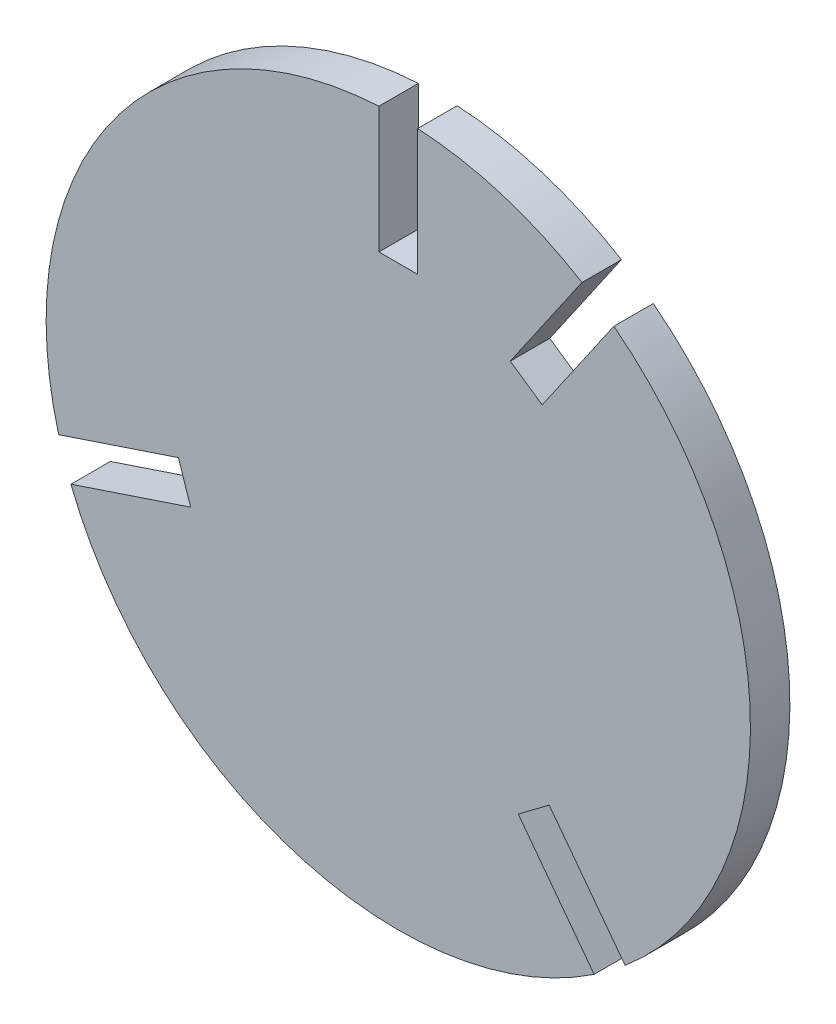
ISO-10303-21;
HEADER;
FILE_DESCRIPTION(('STEP AP214'),'2;1');
FILE_NAME('part.step','',(''),(''),'','','');
FILE_SCHEMA(('AUTOMOTIVE_DESIGN { 1 0 10303 214 1 1 1 1 }'));
ENDSEC;
DATA;
#1=APPLICATION_CONTEXT('core data for automotive mechanical design processes');
#2=APPLICATION_PROTOCOL_DEFINITION('international standard','automotive_design',2000,#1);
#3=PRODUCT_CONTEXT('',#1,'mechanical');
#4=PRODUCT('Part','Part','',(#3));
#5=PRODUCT_RELATED_PRODUCT_CATEGORY('part','',(#4));
#6=PRODUCT_DEFINITION_FORMATION('','',#4);
#7=PRODUCT_DEFINITION_CONTEXT('part definition',#1,'design');
#8=PRODUCT_DEFINITION('design','',#6,#7);
#9=PRODUCT_DEFINITION_SHAPE('','',#8);
#10=(LENGTH_UNIT() NAMED_UNIT(*) SI_UNIT(.MILLI.,.METRE.));
#11=(NAMED_UNIT(*) PLANE_ANGLE_UNIT() SI_UNIT($,.RADIAN.));
#12=(NAMED_UNIT(*) SI_UNIT($,.STERADIAN.) SOLID_ANGLE_UNIT());
#13=UNCERTAINTY_MEASURE_WITH_UNIT(LENGTH_MEASURE(1.E-05),#10,'distance_accuracy_value','');
#14=(GEOMETRIC_REPRESENTATION_CONTEXT(3) GLOBAL_UNCERTAINTY_ASSIGNED_CONTEXT((#13)) GLOBAL_UNIT_ASSIGNED_CONTEXT((#10,
#11,#12)) REPRESENTATION_CONTEXT('',''));
#15=CARTESIAN_POINT('',(0.,0.,0.));
#16=DIRECTION('',(0.,0.,1.));
#17=DIRECTION('',(1.,0.,0.));
#18=AXIS2_PLACEMENT_3D('',#15,#16,#17);
#19=CARTESIAN_POINT('',(0.,0.,2.8));
#20=DIRECTION('',(0.,0.,-1.));
#21=DIRECTION('',(-1.,0.,0.));
#22=AXIS2_PLACEMENT_3D('',#19,#20,#21);
#23=CYLINDRICAL_SURFACE('',#22,25.);
#24=DIRECTION('',(0.,0.,-1.));
#25=VECTOR('',#24,1.);
#26=CARTESIAN_POINT('',(-24.1119608078062,-6.60404012728722,2.8));
#27=LINE('',#26,#25);
#28=CARTESIAN_POINT('',(-24.1119608078062,-6.60404012728722,2.8));
#29=VERTEX_POINT('',#28);
#30=CARTESIAN_POINT('',(-24.1119608078062,-6.60404012728722,0.));
#31=VERTEX_POINT('',#30);
#32=EDGE_CURVE('E215',#29,#31,#27,.T.);
#33=ORIENTED_EDGE('',*,*,#32,.F.);
#34=CARTESIAN_POINT('',(0.,0.,2.8));
#35=DIRECTION('',(0.,0.,1.));
#36=DIRECTION('',(1.,0.,0.));
#37=AXIS2_PLACEMENT_3D('',#34,#35,#36);
#38=CIRCLE('',#37,25.);
#39=CARTESIAN_POINT('',(-1.375,24.9621588609639,2.8));
#40=VERTEX_POINT('',#39);
#41=EDGE_CURVE('E241',#40,#29,#38,.T.);
#42=ORIENTED_EDGE('',*,*,#41,.F.);
#43=DIRECTION('',(0.,0.,-1.));
#44=VECTOR('',#43,1.);
#45=CARTESIAN_POINT('',(-1.375,24.9621588609639,2.8));
#46=LINE('',#45,#44);
#47=CARTESIAN_POINT('',(-1.375,24.9621588609639,0.));
#48=VERTEX_POINT('',#47);
#49=EDGE_CURVE('E235',#48,#40,#46,.F.);
#50=ORIENTED_EDGE('',*,*,#49,.F.);
#51=CARTESIAN_POINT('',(0.,0.,0.));
#52=DIRECTION('',(0.,0.,1.));
#53=DIRECTION('',(1.,0.,0.));
#54=AXIS2_PLACEMENT_3D('',#51,#52,#53);
#55=CIRCLE('',#54,25.);
#56=EDGE_CURVE('E246',#48,#31,#55,.T.);
#57=ORIENTED_EDGE('',*,*,#56,.T.);
#58=EDGE_LOOP('',(#33,#42,#50,#57));
#59=FACE_BOUND('',#58,.T.);
#60=ADVANCED_FACE('F33',(#59),#23,.T.);
#61=DIRECTION('',(0.,0.,-1.));
#62=VECTOR('',#61,1.);
#63=CARTESIAN_POINT('',(-23.2407386102802,-9.21238670750582,2.8));
#64=LINE('',#63,#62);
#65=CARTESIAN_POINT('',(-23.2407386102802,-9.21238670750582,0.));
#66=VERTEX_POINT('',#65);
#67=CARTESIAN_POINT('',(-23.2407386102802,-9.21238670750582,2.8));
#68=VERTEX_POINT('',#67);
#69=EDGE_CURVE('E151',#66,#68,#64,.F.);
#70=ORIENTED_EDGE('',*,*,#69,.F.);
#71=CARTESIAN_POINT('',(13.902727623008,-20.7777324229679,0.));
#72=VERTEX_POINT('',#71);
#73=EDGE_CURVE('E249',#66,#72,#55,.T.);
#74=ORIENTED_EDGE('',*,*,#73,.T.);
#75=DIRECTION('',(0.,0.,-1.));
#76=VECTOR('',#75,1.);
#77=CARTESIAN_POINT('',(13.902727623008,-20.7777324229679,2.8));
#78=LINE('',#77,#76);
#79=CARTESIAN_POINT('',(13.902727623008,-20.7777324229679,2.8));
#80=VERTEX_POINT('',#79);
#81=EDGE_CURVE('E212',#80,#72,#78,.T.);
#82=ORIENTED_EDGE('',*,*,#81,.F.);
#83=EDGE_CURVE('E244',#68,#80,#38,.T.);
#84=ORIENTED_EDGE('',*,*,#83,.F.);
#85=EDGE_LOOP('',(#70,#74,#82,#84));
#86=FACE_BOUND('',#85,.T.);
#87=ADVANCED_FACE('F297',(#86),#23,.T.);
#88=DIRECTION('',(0.,0.,-1.));
#89=VECTOR('',#88,1.);
#90=CARTESIAN_POINT('',(16.1007071739448,-19.1250419214935,2.8));
#91=LINE('',#90,#89);
#92=CARTESIAN_POINT('',(16.1007071739448,-19.1250419214935,0.));
#93=VERTEX_POINT('',#92);
#94=CARTESIAN_POINT('',(16.1007071739448,-19.1250419214935,2.8));
#95=VERTEX_POINT('',#94);
#96=EDGE_CURVE('E210',#93,#95,#91,.F.);
#97=ORIENTED_EDGE('',*,*,#96,.F.);
#98=CARTESIAN_POINT('',(15.3029681450269,19.7691468190282,0.));
#99=VERTEX_POINT('',#98);
#100=EDGE_CURVE('E266',#93,#99,#55,.T.);
#101=ORIENTED_EDGE('',*,*,#100,.T.);
#102=DIRECTION('',(0.,0.,-1.));
#103=VECTOR('',#102,1.);
#104=CARTESIAN_POINT('',(15.3029681450269,19.7691468190282,2.8));
#105=LINE('',#104,#103);
#106=CARTESIAN_POINT('',(15.3029681450269,19.7691468190282,2.8));
#107=VERTEX_POINT('',#106);
#108=EDGE_CURVE('E208',#107,#99,#105,.T.);
#109=ORIENTED_EDGE('',*,*,#108,.F.);
#110=EDGE_CURVE('E268',#95,#107,#38,.T.);
#111=ORIENTED_EDGE('',*,*,#110,.F.);
#112=EDGE_LOOP('',(#97,#101,#109,#111));
#113=FACE_BOUND('',#112,.T.);
#114=ADVANCED_FACE('F264',(#113),#23,.T.);
#115=DIRECTION('',(0.,0.,-1.));
#116=VECTOR('',#115,1.);
#117=CARTESIAN_POINT('',(13.0390706206033,21.330322017047,2.8));
#118=LINE('',#117,#116);
#119=CARTESIAN_POINT('',(13.0390706206033,21.330322017047,0.));
#120=VERTEX_POINT('',#119);
#121=CARTESIAN_POINT('',(13.0390706206033,21.330322017047,2.8));
#122=VERTEX_POINT('',#121);
#123=EDGE_CURVE('E164',#120,#122,#118,.F.);
#124=ORIENTED_EDGE('',*,*,#123,.F.);
#125=CARTESIAN_POINT('',(1.375,24.9621588609639,0.));
#126=VERTEX_POINT('',#125);
#127=EDGE_CURVE('E240',#120,#126,#55,.T.);
#128=ORIENTED_EDGE('',*,*,#127,.T.);
#129=DIRECTION('',(0.,0.,-1.));
#130=VECTOR('',#129,1.);
#131=CARTESIAN_POINT('',(1.375,24.9621588609639,2.8));
#132=LINE('',#131,#130);
#133=CARTESIAN_POINT('',(1.375,24.9621588609639,2.8));
#134=VERTEX_POINT('',#133);
#135=EDGE_CURVE('E237',#134,#126,#132,.T.);
#136=ORIENTED_EDGE('',*,*,#135,.F.);
#137=EDGE_CURVE('E245',#122,#134,#38,.T.);
#138=ORIENTED_EDGE('',*,*,#137,.F.);
#139=EDGE_LOOP('',(#124,#128,#136,#138));
#140=FACE_BOUND('',#139,.T.);
#141=ADVANCED_FACE('F275',(#140),#23,.T.);
#142=CARTESIAN_POINT('',(0.,0.,2.8));
#143=DIRECTION('',(0.,0.,1.));
#144=DIRECTION('',(1.,0.,0.));
#145=AXIS2_PLACEMENT_3D('',#142,#143,#144);
#146=PLANE('',#145);
#147=ORIENTED_EDGE('',*,*,#41,.T.);
#148=DIRECTION('',(-0.948489665534038,-0.316808071827612,0.));
#149=VECTOR('',#148,1.);
#150=CARTESIAN_POINT('',(-32.6842597269203,-9.4673011520295,2.8));
#151=LINE('',#150,#149);
#152=CARTESIAN_POINT('',(-15.6114457473076,-3.76475585913249,2.8));
#153=VERTEX_POINT('',#152);
#154=EDGE_CURVE('E157',#153,#29,#151,.T.);
#155=ORIENTED_EDGE('',*,*,#154,.F.);
#156=DIRECTION('',(-0.316808071827612,0.948489665534038,0.));
#157=VECTOR('',#156,1.);
#158=CARTESIAN_POINT('',(-14.7402235497816,-6.37310243935109,2.8));
#159=LINE('',#158,#157);
#160=CARTESIAN_POINT('',(-14.7402235497816,-6.37310243935109,2.8));
#161=VERTEX_POINT('',#160);
#162=EDGE_CURVE('E156',#161,#153,#159,.T.);
#163=ORIENTED_EDGE('',*,*,#162,.F.);
#164=DIRECTION('',(0.948489665534038,0.316808071827612,0.));
#165=VECTOR('',#164,1.);
#166=CARTESIAN_POINT('',(-31.8130375293943,-12.0756477322481,2.8));
#167=LINE('',#166,#165);
#168=EDGE_CURVE('E145',#68,#161,#167,.T.);
#169=ORIENTED_EDGE('',*,*,#168,.F.);
#170=ORIENTED_EDGE('',*,*,#83,.T.);
#171=DIRECTION('',(0.60097836417251,-0.799265291249741,0.));
#172=VECTOR('',#171,1.);
#173=CARTESIAN_POINT('',(19.3342746063969,-28.0013651532284,2.8));
#174=LINE('',#173,#172);
#175=CARTESIAN_POINT('',(8.51666405129176,-13.6145899107331,2.8));
#176=VERTEX_POINT('',#175);
#177=EDGE_CURVE('E177',#176,#80,#174,.T.);
#178=ORIENTED_EDGE('',*,*,#177,.F.);
#179=DIRECTION('',(-0.799265291249742,-0.60097836417251,0.));
#180=VECTOR('',#179,1.);
#181=CARTESIAN_POINT('',(10.7146436022286,-11.9618994092587,2.8));
#182=LINE('',#181,#180);
#183=CARTESIAN_POINT('',(10.7146436022286,-11.9618994092587,2.8));
#184=VERTEX_POINT('',#183);
#185=EDGE_CURVE('E182',#184,#176,#182,.T.);
#186=ORIENTED_EDGE('',*,*,#185,.F.);
#187=DIRECTION('',(-0.60097836417251,0.799265291249741,0.));
#188=VECTOR('',#187,1.);
#189=CARTESIAN_POINT('',(21.5322541573337,-26.348674651754,2.8));
#190=LINE('',#189,#188);
#191=EDGE_CURVE('E179',#95,#184,#190,.T.);
#192=ORIENTED_EDGE('',*,*,#191,.F.);
#193=ORIENTED_EDGE('',*,*,#110,.T.);
#194=DIRECTION('',(0.567700072006827,0.823235463426743,0.));
#195=VECTOR('',#194,1.);
#196=CARTESIAN_POINT('',(20.4337512104439,27.2094181574999,2.8));
#197=LINE('',#196,#195);
#198=CARTESIAN_POINT('',(10.215149914321,12.3911798158185,2.8));
#199=VERTEX_POINT('',#198);
#200=EDGE_CURVE('E191',#199,#107,#197,.T.);
#201=ORIENTED_EDGE('',*,*,#200,.F.);
#202=DIRECTION('',(0.823235463426742,-0.567700072006827,0.));
#203=VECTOR('',#202,1.);
#204=CARTESIAN_POINT('',(7.95125238989747,13.9523550138373,2.8));
#205=LINE('',#204,#203);
#206=CARTESIAN_POINT('',(7.95125238989747,13.9523550138373,2.8));
#207=VERTEX_POINT('',#206);
#208=EDGE_CURVE('E196',#207,#199,#205,.T.);
#209=ORIENTED_EDGE('',*,*,#208,.F.);
#210=DIRECTION('',(-0.567700072006827,-0.823235463426743,0.));
#211=VECTOR('',#210,1.);
#212=CARTESIAN_POINT('',(18.1698536860204,28.7705933555186,2.8));
#213=LINE('',#212,#211);
#214=EDGE_CURVE('E193',#122,#207,#213,.T.);
#215=ORIENTED_EDGE('',*,*,#214,.F.);
#216=ORIENTED_EDGE('',*,*,#137,.T.);
#217=DIRECTION('',(0.,1.,0.));
#218=VECTOR('',#217,1.);
#219=CARTESIAN_POINT('',(1.375,34.,2.8));
#220=LINE('',#219,#218);
#221=CARTESIAN_POINT('',(1.375,16.,2.8));
#222=VERTEX_POINT('',#221);
#223=EDGE_CURVE('E218',#222,#134,#220,.T.);
#224=ORIENTED_EDGE('',*,*,#223,.F.);
#225=DIRECTION('',(1.,0.,0.));
#226=VECTOR('',#225,1.);
#227=CARTESIAN_POINT('',(-1.375,16.,2.8));
#228=LINE('',#227,#226);
#229=CARTESIAN_POINT('',(-1.375,16.,2.8));
#230=VERTEX_POINT('',#229);
#231=EDGE_CURVE('E224',#230,#222,#228,.T.);
#232=ORIENTED_EDGE('',*,*,#231,.F.);
#233=DIRECTION('',(0.,-1.,0.));
#234=VECTOR('',#233,1.);
#235=CARTESIAN_POINT('',(-1.375,34.,2.8));
#236=LINE('',#235,#234);
#237=EDGE_CURVE('E221',#40,#230,#236,.T.);
#238=ORIENTED_EDGE('',*,*,#237,.F.);
#239=EDGE_LOOP('',(#147,#155,#163,#169,#170,#178,#186,#192,#193,#201,#209,#215,#216,#224,#232,#238));
#240=FACE_BOUND('',#239,.T.);
#241=ADVANCED_FACE('F169',(#240),#146,.T.);
#242=CARTESIAN_POINT('',(0.,0.,0.));
#243=DIRECTION('',(0.,0.,1.));
#244=DIRECTION('',(1.,0.,0.));
#245=AXIS2_PLACEMENT_3D('',#242,#243,#244);
#246=PLANE('',#245);
#247=DIRECTION('',(-0.948489665534038,-0.316808071827612,0.));
#248=VECTOR('',#247,1.);
#249=CARTESIAN_POINT('',(-32.6842597269203,-9.4673011520295,0.));
#250=LINE('',#249,#248);
#251=CARTESIAN_POINT('',(-15.6114457473076,-3.76475585913249,0.));
#252=VERTEX_POINT('',#251);
#253=EDGE_CURVE('E47',#252,#31,#250,.T.);
#254=ORIENTED_EDGE('',*,*,#253,.T.);
#255=ORIENTED_EDGE('',*,*,#56,.F.);
#256=DIRECTION('',(0.,1.,0.));
#257=VECTOR('',#256,1.);
#258=CARTESIAN_POINT('',(-1.375,0.,0.));
#259=LINE('',#258,#257);
#260=CARTESIAN_POINT('',(-1.375,16.,0.));
#261=VERTEX_POINT('',#260);
#262=EDGE_CURVE('E243',#261,#48,#259,.T.);
#263=ORIENTED_EDGE('',*,*,#262,.F.);
#264=DIRECTION('',(1.,0.,0.));
#265=VECTOR('',#264,1.);
#266=CARTESIAN_POINT('',(-1.375,16.,0.));
#267=LINE('',#266,#265);
#268=CARTESIAN_POINT('',(1.375,16.,0.));
#269=VERTEX_POINT('',#268);
#270=EDGE_CURVE('E222',#261,#269,#267,.T.);
#271=ORIENTED_EDGE('',*,*,#270,.T.);
#272=DIRECTION('',(0.,1.,0.));
#273=VECTOR('',#272,1.);
#274=CARTESIAN_POINT('',(1.375,34.,0.));
#275=LINE('',#274,#273);
#276=EDGE_CURVE('E217',#269,#126,#275,.T.);
#277=ORIENTED_EDGE('',*,*,#276,.T.);
#278=ORIENTED_EDGE('',*,*,#127,.F.);
#279=DIRECTION('',(0.567700072006827,0.823235463426742,0.));
#280=VECTOR('',#279,1.);
#281=CARTESIAN_POINT('',(-1.13194876221177,0.780587599009385,0.));
#282=LINE('',#281,#280);
#283=CARTESIAN_POINT('',(7.95125238989747,13.9523550138373,0.));
#284=VERTEX_POINT('',#283);
#285=EDGE_CURVE('E251',#284,#120,#282,.T.);
#286=ORIENTED_EDGE('',*,*,#285,.F.);
#287=DIRECTION('',(0.823235463426742,-0.567700072006827,0.));
#288=VECTOR('',#287,1.);
#289=CARTESIAN_POINT('',(7.95125238989747,13.9523550138373,0.));
#290=LINE('',#289,#288);
#291=CARTESIAN_POINT('',(10.215149914321,12.3911798158185,0.));
#292=VERTEX_POINT('',#291);
#293=EDGE_CURVE('E194',#284,#292,#290,.T.);
#294=ORIENTED_EDGE('',*,*,#293,.T.);
#295=DIRECTION('',(0.567700072006827,0.823235463426743,0.));
#296=VECTOR('',#295,1.);
#297=CARTESIAN_POINT('',(20.4337512104439,27.2094181574999,0.));
#298=LINE('',#297,#296);
#299=EDGE_CURVE('E199',#292,#99,#298,.T.);
#300=ORIENTED_EDGE('',*,*,#299,.T.);
#301=ORIENTED_EDGE('',*,*,#100,.F.);
#302=DIRECTION('',(0.60097836417251,-0.799265291249741,0.));
#303=VECTOR('',#302,1.);
#304=CARTESIAN_POINT('',(1.09898977546839,0.826345250737198,0.));
#305=LINE('',#304,#303);
#306=CARTESIAN_POINT('',(10.7146436022286,-11.9618994092587,0.));
#307=VERTEX_POINT('',#306);
#308=EDGE_CURVE('E40',#307,#93,#305,.T.);
#309=ORIENTED_EDGE('',*,*,#308,.F.);
#310=DIRECTION('',(-0.799265291249742,-0.60097836417251,0.));
#311=VECTOR('',#310,1.);
#312=CARTESIAN_POINT('',(10.7146436022286,-11.9618994092587,0.));
#313=LINE('',#312,#311);
#314=CARTESIAN_POINT('',(8.51666405129176,-13.6145899107331,0.));
#315=VERTEX_POINT('',#314);
#316=EDGE_CURVE('E180',#307,#315,#313,.T.);
#317=ORIENTED_EDGE('',*,*,#316,.T.);
#318=DIRECTION('',(0.60097836417251,-0.799265291249741,0.));
#319=VECTOR('',#318,1.);
#320=CARTESIAN_POINT('',(19.3342746063969,-28.0013651532284,0.));
#321=LINE('',#320,#319);
#322=EDGE_CURVE('E55',#315,#72,#321,.T.);
#323=ORIENTED_EDGE('',*,*,#322,.T.);
#324=ORIENTED_EDGE('',*,*,#73,.F.);
#325=DIRECTION('',(-0.948489665534038,-0.316808071827612,0.));
#326=VECTOR('',#325,1.);
#327=CARTESIAN_POINT('',(0.435611098762966,-1.3041732901093,0.));
#328=LINE('',#327,#326);
#329=CARTESIAN_POINT('',(-14.7402235497816,-6.37310243935109,0.));
#330=VERTEX_POINT('',#329);
#331=EDGE_CURVE('E11',#330,#66,#328,.T.);
#332=ORIENTED_EDGE('',*,*,#331,.F.);
#333=DIRECTION('',(-0.316808071827612,0.948489665534038,0.));
#334=VECTOR('',#333,1.);
#335=CARTESIAN_POINT('',(-14.7402235497816,-6.37310243935109,0.));
#336=LINE('',#335,#334);
#337=EDGE_CURVE('E162',#330,#252,#336,.T.);
#338=ORIENTED_EDGE('',*,*,#337,.T.);
#339=EDGE_LOOP('',(#254,#255,#263,#271,#277,#278,#286,#294,#300,#301,#309,#317,#323,#324,#332,#338));
#340=FACE_BOUND('',#339,.T.);
#341=ADVANCED_FACE('F269',(#340),#246,.F.);
#342=CARTESIAN_POINT('',(1.375,34.,2.8));
#343=DIRECTION('',(-1.,0.,0.));
#344=DIRECTION('',(0.,-1.,0.));
#345=AXIS2_PLACEMENT_3D('',#342,#343,#344);
#346=PLANE('',#345);
#347=ORIENTED_EDGE('',*,*,#135,.T.);
#348=ORIENTED_EDGE('',*,*,#276,.F.);
#349=DIRECTION('',(0.,0.,-1.));
#350=VECTOR('',#349,1.);
#351=CARTESIAN_POINT('',(1.375,16.,2.8));
#352=LINE('',#351,#350);
#353=EDGE_CURVE('E226',#222,#269,#352,.T.);
#354=ORIENTED_EDGE('',*,*,#353,.F.);
#355=ORIENTED_EDGE('',*,*,#223,.T.);
#356=EDGE_LOOP('',(#347,#348,#354,#355));
#357=FACE_BOUND('',#356,.T.);
#358=ADVANCED_FACE('F279',(#357),#346,.T.);
#359=CARTESIAN_POINT('',(-1.375,34.,2.8));
#360=DIRECTION('',(1.,0.,0.));
#361=DIRECTION('',(0.,1.,0.));
#362=AXIS2_PLACEMENT_3D('',#359,#360,#361);
#363=PLANE('',#362);
#364=ORIENTED_EDGE('',*,*,#49,.T.);
#365=ORIENTED_EDGE('',*,*,#237,.T.);
#366=DIRECTION('',(0.,0.,-1.));
#367=VECTOR('',#366,1.);
#368=CARTESIAN_POINT('',(-1.375,16.,2.8));
#369=LINE('',#368,#367);
#370=EDGE_CURVE('E233',#230,#261,#369,.T.);
#371=ORIENTED_EDGE('',*,*,#370,.T.);
#372=ORIENTED_EDGE('',*,*,#262,.T.);
#373=EDGE_LOOP('',(#364,#365,#371,#372));
#374=FACE_BOUND('',#373,.T.);
#375=ADVANCED_FACE('F344',(#374),#363,.T.);
#376=CARTESIAN_POINT('',(-1.375,16.,2.8));
#377=DIRECTION('',(0.,1.,0.));
#378=DIRECTION('',(0.,0.,1.));
#379=AXIS2_PLACEMENT_3D('',#376,#377,#378);
#380=PLANE('',#379);
#381=ORIENTED_EDGE('',*,*,#270,.F.);
#382=ORIENTED_EDGE('',*,*,#370,.F.);
#383=ORIENTED_EDGE('',*,*,#231,.T.);
#384=ORIENTED_EDGE('',*,*,#353,.T.);
#385=EDGE_LOOP('',(#381,#382,#383,#384));
#386=FACE_BOUND('',#385,.T.);
#387=ADVANCED_FACE('F287',(#386),#380,.T.);
#388=CARTESIAN_POINT('',(20.4337512104439,27.2094181574999,2.8));
#389=DIRECTION('',(-0.823235463426742,0.567700072006827,0.));
#390=DIRECTION('',(-0.567700072006827,-0.823235463426742,0.));
#391=AXIS2_PLACEMENT_3D('',#388,#389,#390);
#392=PLANE('',#391);
#393=ORIENTED_EDGE('',*,*,#108,.T.);
#394=ORIENTED_EDGE('',*,*,#299,.F.);
#395=DIRECTION('',(0.,0.,-1.));
#396=VECTOR('',#395,1.);
#397=CARTESIAN_POINT('',(10.215149914321,12.3911798158185,2.8));
#398=LINE('',#397,#396);
#399=EDGE_CURVE('E198',#199,#292,#398,.T.);
#400=ORIENTED_EDGE('',*,*,#399,.F.);
#401=ORIENTED_EDGE('',*,*,#200,.T.);
#402=EDGE_LOOP('',(#393,#394,#400,#401));
#403=FACE_BOUND('',#402,.T.);
#404=ADVANCED_FACE('F343',(#403),#392,.T.);
#405=CARTESIAN_POINT('',(18.1698536860204,28.7705933555186,2.8));
#406=DIRECTION('',(0.823235463426742,-0.567700072006827,0.));
#407=DIRECTION('',(0.567700072006827,0.823235463426742,0.));
#408=AXIS2_PLACEMENT_3D('',#405,#406,#407);
#409=PLANE('',#408);
#410=ORIENTED_EDGE('',*,*,#123,.T.);
#411=ORIENTED_EDGE('',*,*,#214,.T.);
#412=DIRECTION('',(0.,0.,-1.));
#413=VECTOR('',#412,1.);
#414=CARTESIAN_POINT('',(7.95125238989747,13.9523550138373,2.8));
#415=LINE('',#414,#413);
#416=EDGE_CURVE('E186',#207,#284,#415,.T.);
#417=ORIENTED_EDGE('',*,*,#416,.T.);
#418=ORIENTED_EDGE('',*,*,#285,.T.);
#419=EDGE_LOOP('',(#410,#411,#417,#418));
#420=FACE_BOUND('',#419,.T.);
#421=ADVANCED_FACE('F388',(#420),#409,.T.);
#422=CARTESIAN_POINT('',(7.95125238989747,13.9523550138373,2.8));
#423=DIRECTION('',(0.567700072006827,0.823235463426742,0.));
#424=DIRECTION('',(-0.823235463426742,0.567700072006827,0.));
#425=AXIS2_PLACEMENT_3D('',#422,#423,#424);
#426=PLANE('',#425);
#427=ORIENTED_EDGE('',*,*,#293,.F.);
#428=ORIENTED_EDGE('',*,*,#416,.F.);
#429=ORIENTED_EDGE('',*,*,#208,.T.);
#430=ORIENTED_EDGE('',*,*,#399,.T.);
#431=EDGE_LOOP('',(#427,#428,#429,#430));
#432=FACE_BOUND('',#431,.T.);
#433=ADVANCED_FACE('F398',(#432),#426,.T.);
#434=CARTESIAN_POINT('',(19.3342746063969,-28.0013651532284,2.8));
#435=DIRECTION('',(0.799265291249741,0.60097836417251,0.));
#436=DIRECTION('',(-0.60097836417251,0.799265291249741,0.));
#437=AXIS2_PLACEMENT_3D('',#434,#435,#436);
#438=PLANE('',#437);
#439=ORIENTED_EDGE('',*,*,#81,.T.);
#440=ORIENTED_EDGE('',*,*,#322,.F.);
#441=DIRECTION('',(0.,0.,-1.));
#442=VECTOR('',#441,1.);
#443=CARTESIAN_POINT('',(8.51666405129176,-13.6145899107331,2.8));
#444=LINE('',#443,#442);
#445=EDGE_CURVE('E184',#176,#315,#444,.T.);
#446=ORIENTED_EDGE('',*,*,#445,.F.);
#447=ORIENTED_EDGE('',*,*,#177,.T.);
#448=EDGE_LOOP('',(#439,#440,#446,#447));
#449=FACE_BOUND('',#448,.T.);
#450=ADVANCED_FACE('F299',(#449),#438,.T.);
#451=CARTESIAN_POINT('',(21.5322541573337,-26.348674651754,2.8));
#452=DIRECTION('',(-0.799265291249741,-0.60097836417251,0.));
#453=DIRECTION('',(0.60097836417251,-0.799265291249741,0.));
#454=AXIS2_PLACEMENT_3D('',#451,#452,#453);
#455=PLANE('',#454);
#456=ORIENTED_EDGE('',*,*,#96,.T.);
#457=ORIENTED_EDGE('',*,*,#191,.T.);
#458=DIRECTION('',(0.,0.,-1.));
#459=VECTOR('',#458,1.);
#460=CARTESIAN_POINT('',(10.7146436022286,-11.9618994092587,2.8));
#461=LINE('',#460,#459);
#462=EDGE_CURVE('E175',#184,#307,#461,.T.);
#463=ORIENTED_EDGE('',*,*,#462,.T.);
#464=ORIENTED_EDGE('',*,*,#308,.T.);
#465=EDGE_LOOP('',(#456,#457,#463,#464));
#466=FACE_BOUND('',#465,.T.);
#467=ADVANCED_FACE('F255',(#466),#455,.T.);
#468=CARTESIAN_POINT('',(10.7146436022286,-11.9618994092587,2.8));
#469=DIRECTION('',(0.60097836417251,-0.799265291249742,0.));
#470=DIRECTION('',(0.799265291249742,0.60097836417251,0.));
#471=AXIS2_PLACEMENT_3D('',#468,#469,#470);
#472=PLANE('',#471);
#473=ORIENTED_EDGE('',*,*,#316,.F.);
#474=ORIENTED_EDGE('',*,*,#462,.F.);
#475=ORIENTED_EDGE('',*,*,#185,.T.);
#476=ORIENTED_EDGE('',*,*,#445,.T.);
#477=EDGE_LOOP('',(#473,#474,#475,#476));
#478=FACE_BOUND('',#477,.T.);
#479=ADVANCED_FACE('F301',(#478),#472,.T.);
#480=CARTESIAN_POINT('',(-32.6842597269203,-9.4673011520295,2.8));
#481=DIRECTION('',(0.316808071827612,-0.948489665534038,0.));
#482=DIRECTION('',(0.948489665534038,0.316808071827612,0.));
#483=AXIS2_PLACEMENT_3D('',#480,#481,#482);
#484=PLANE('',#483);
#485=ORIENTED_EDGE('',*,*,#32,.T.);
#486=ORIENTED_EDGE('',*,*,#253,.F.);
#487=DIRECTION('',(0.,0.,-1.));
#488=VECTOR('',#487,1.);
#489=CARTESIAN_POINT('',(-15.6114457473076,-3.76475585913249,2.8));
#490=LINE('',#489,#488);
#491=EDGE_CURVE('E165',#153,#252,#490,.T.);
#492=ORIENTED_EDGE('',*,*,#491,.F.);
#493=ORIENTED_EDGE('',*,*,#154,.T.);
#494=EDGE_LOOP('',(#485,#486,#492,#493));
#495=FACE_BOUND('',#494,.T.);
#496=ADVANCED_FACE('F303',(#495),#484,.T.);
#497=CARTESIAN_POINT('',(-31.8130375293943,-12.0756477322481,2.8));
#498=DIRECTION('',(-0.316808071827612,0.948489665534038,0.));
#499=DIRECTION('',(-0.948489665534038,-0.316808071827612,0.));
#500=AXIS2_PLACEMENT_3D('',#497,#498,#499);
#501=PLANE('',#500);
#502=ORIENTED_EDGE('',*,*,#69,.T.);
#503=ORIENTED_EDGE('',*,*,#168,.T.);
#504=DIRECTION('',(0.,0.,-1.));
#505=VECTOR('',#504,1.);
#506=CARTESIAN_POINT('',(-14.7402235497816,-6.37310243935109,2.8));
#507=LINE('',#506,#505);
#508=EDGE_CURVE('E148',#161,#330,#507,.T.);
#509=ORIENTED_EDGE('',*,*,#508,.T.);
#510=ORIENTED_EDGE('',*,*,#331,.T.);
#511=EDGE_LOOP('',(#502,#503,#509,#510));
#512=FACE_BOUND('',#511,.T.);
#513=ADVANCED_FACE('F147',(#512),#501,.T.);
#514=CARTESIAN_POINT('',(-14.7402235497816,-6.37310243935109,2.8));
#515=DIRECTION('',(-0.948489665534038,-0.316808071827612,0.));
#516=DIRECTION('',(0.316808071827612,-0.948489665534038,0.));
#517=AXIS2_PLACEMENT_3D('',#514,#515,#516);
#518=PLANE('',#517);
#519=ORIENTED_EDGE('',*,*,#337,.F.);
#520=ORIENTED_EDGE('',*,*,#508,.F.);
#521=ORIENTED_EDGE('',*,*,#162,.T.);
#522=ORIENTED_EDGE('',*,*,#491,.T.);
#523=EDGE_LOOP('',(#519,#520,#521,#522));
#524=FACE_BOUND('',#523,.T.);
#525=ADVANCED_FACE('F160',(#524),#518,.T.);
#526=CLOSED_SHELL('',(#60,#87,#114,#141,#241,#341,#358,#375,#387,#404,#421,#433,#450,#467,#479,
#496,#513,#525));
#527=MANIFOLD_SOLID_BREP('B2',#526);
#528=ADVANCED_BREP_SHAPE_REPRESENTATION('',(#18,#527),#14);
#529=SHAPE_DEFINITION_REPRESENTATION(#9,#528);
ENDSEC;
END-ISO-10303-21;
